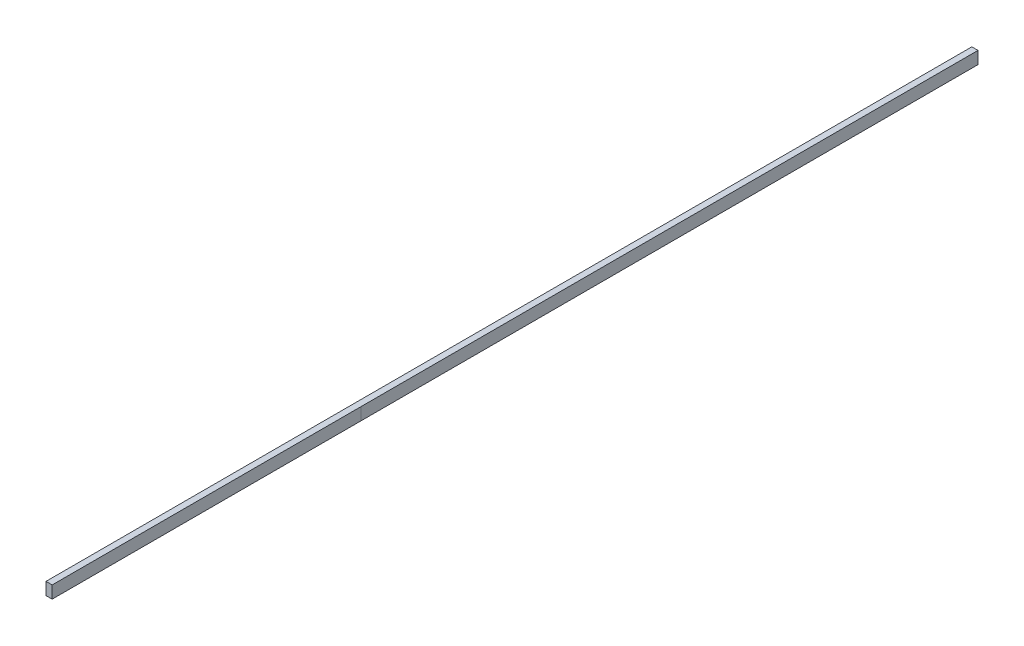
ISO-10303-21;
HEADER;
FILE_DESCRIPTION(('STEP AP214'),'2;1');
FILE_NAME('part.step','',(''),(''),'','','');
FILE_SCHEMA(('AUTOMOTIVE_DESIGN { 1 0 10303 214 1 1 1 1 }'));
ENDSEC;
DATA;
#1=APPLICATION_CONTEXT('core data for automotive mechanical design processes');
#2=APPLICATION_PROTOCOL_DEFINITION('international standard','automotive_design',2000,#1);
#3=PRODUCT_CONTEXT('',#1,'mechanical');
#4=PRODUCT('Part','Part','',(#3));
#5=PRODUCT_RELATED_PRODUCT_CATEGORY('part','',(#4));
#6=PRODUCT_DEFINITION_FORMATION('','',#4);
#7=PRODUCT_DEFINITION_CONTEXT('part definition',#1,'design');
#8=PRODUCT_DEFINITION('design','',#6,#7);
#9=PRODUCT_DEFINITION_SHAPE('','',#8);
#10=(LENGTH_UNIT() NAMED_UNIT(*) SI_UNIT(.MILLI.,.METRE.));
#11=(NAMED_UNIT(*) PLANE_ANGLE_UNIT() SI_UNIT($,.RADIAN.));
#12=(NAMED_UNIT(*) SI_UNIT($,.STERADIAN.) SOLID_ANGLE_UNIT());
#13=UNCERTAINTY_MEASURE_WITH_UNIT(LENGTH_MEASURE(1.E-05),#10,'distance_accuracy_value','');
#14=(GEOMETRIC_REPRESENTATION_CONTEXT(3) GLOBAL_UNCERTAINTY_ASSIGNED_CONTEXT((#13)) GLOBAL_UNIT_ASSIGNED_CONTEXT((#10,
#11,#12)) REPRESENTATION_CONTEXT('',''));
#15=CARTESIAN_POINT('',(0.,0.,0.));
#16=DIRECTION('',(0.,0.,1.));
#17=DIRECTION('',(1.,0.,0.));
#18=AXIS2_PLACEMENT_3D('',#15,#16,#17);
#19=CARTESIAN_POINT('',(10.,0.,1500.));
#20=DIRECTION('',(-1.,0.,0.));
#21=DIRECTION('',(0.,0.,1.));
#22=AXIS2_PLACEMENT_3D('',#19,#20,#21);
#23=PLANE('',#22);
#24=DIRECTION('',(0.,-1.,0.));
#25=VECTOR('',#24,1.);
#26=CARTESIAN_POINT('',(10.,0.,1000.));
#27=LINE('',#26,#25);
#28=CARTESIAN_POINT('',(10.,20.,1000.));
#29=VERTEX_POINT('',#28);
#30=CARTESIAN_POINT('',(10.,0.,1000.));
#31=VERTEX_POINT('',#30);
#32=EDGE_CURVE('E11',#29,#31,#27,.T.);
#33=ORIENTED_EDGE('',*,*,#32,.F.);
#34=DIRECTION('',(0.,0.,-1.));
#35=VECTOR('',#34,1.);
#36=CARTESIAN_POINT('',(10.,20.,1500.));
#37=LINE('',#36,#35);
#38=CARTESIAN_POINT('',(10.,20.,1500.));
#39=VERTEX_POINT('',#38);
#40=EDGE_CURVE('E134',#39,#29,#37,.T.);
#41=ORIENTED_EDGE('',*,*,#40,.F.);
#42=DIRECTION('',(0.,1.,0.));
#43=VECTOR('',#42,1.);
#44=CARTESIAN_POINT('',(10.,0.,1500.));
#45=LINE('',#44,#43);
#46=CARTESIAN_POINT('',(10.,0.,1500.));
#47=VERTEX_POINT('',#46);
#48=EDGE_CURVE('E109',#47,#39,#45,.T.);
#49=ORIENTED_EDGE('',*,*,#48,.F.);
#50=DIRECTION('',(0.,0.,-1.));
#51=VECTOR('',#50,1.);
#52=CARTESIAN_POINT('',(10.,0.,1500.));
#53=LINE('',#52,#51);
#54=EDGE_CURVE('E106',#47,#31,#53,.T.);
#55=ORIENTED_EDGE('',*,*,#54,.T.);
#56=EDGE_LOOP('',(#33,#41,#49,#55));
#57=FACE_BOUND('',#56,.T.);
#58=ADVANCED_FACE('F43',(#57),#23,.F.);
#59=CARTESIAN_POINT('',(0.,0.,1500.));
#60=DIRECTION('',(1.,0.,0.));
#61=DIRECTION('',(0.,0.,-1.));
#62=AXIS2_PLACEMENT_3D('',#59,#60,#61);
#63=PLANE('',#62);
#64=DIRECTION('',(0.,1.,0.));
#65=VECTOR('',#64,1.);
#66=CARTESIAN_POINT('',(0.,0.,1011.91903946928));
#67=LINE('',#66,#65);
#68=CARTESIAN_POINT('',(0.,0.,1011.91903946928));
#69=VERTEX_POINT('',#68);
#70=CARTESIAN_POINT('',(0.,20.,1011.91903946928));
#71=VERTEX_POINT('',#70);
#72=EDGE_CURVE('E52',#69,#71,#67,.T.);
#73=ORIENTED_EDGE('',*,*,#72,.F.);
#74=DIRECTION('',(0.,0.,-1.));
#75=VECTOR('',#74,1.);
#76=CARTESIAN_POINT('',(0.,0.,1500.));
#77=LINE('',#76,#75);
#78=CARTESIAN_POINT('',(0.,0.,1500.));
#79=VERTEX_POINT('',#78);
#80=EDGE_CURVE('E105',#79,#69,#77,.T.);
#81=ORIENTED_EDGE('',*,*,#80,.F.);
#82=DIRECTION('',(0.,-1.,0.));
#83=VECTOR('',#82,1.);
#84=CARTESIAN_POINT('',(0.,0.,1500.));
#85=LINE('',#84,#83);
#86=CARTESIAN_POINT('',(0.,20.,1500.));
#87=VERTEX_POINT('',#86);
#88=EDGE_CURVE('E110',#87,#79,#85,.T.);
#89=ORIENTED_EDGE('',*,*,#88,.F.);
#90=DIRECTION('',(0.,0.,-1.));
#91=VECTOR('',#90,1.);
#92=CARTESIAN_POINT('',(0.,20.,1500.));
#93=LINE('',#92,#91);
#94=EDGE_CURVE('E139',#87,#71,#93,.T.);
#95=ORIENTED_EDGE('',*,*,#94,.T.);
#96=EDGE_LOOP('',(#73,#81,#89,#95));
#97=FACE_BOUND('',#96,.T.);
#98=ADVANCED_FACE('F121',(#97),#63,.F.);
#99=DIRECTION('',(0.,-1.,0.));
#100=VECTOR('',#99,1.);
#101=CARTESIAN_POINT('',(0.,0.,1000.));
#102=LINE('',#101,#100);
#103=CARTESIAN_POINT('',(0.,20.,1000.));
#104=VERTEX_POINT('',#103);
#105=CARTESIAN_POINT('',(0.,0.,1000.));
#106=VERTEX_POINT('',#105);
#107=EDGE_CURVE('E123',#104,#106,#102,.T.);
#108=ORIENTED_EDGE('',*,*,#107,.F.);
#109=CARTESIAN_POINT('',(0.,20.,0.));
#110=VERTEX_POINT('',#109);
#111=EDGE_CURVE('E142',#104,#110,#93,.T.);
#112=ORIENTED_EDGE('',*,*,#111,.T.);
#113=DIRECTION('',(0.,-1.,0.));
#114=VECTOR('',#113,1.);
#115=CARTESIAN_POINT('',(0.,0.,0.));
#116=LINE('',#115,#114);
#117=CARTESIAN_POINT('',(0.,0.,0.));
#118=VERTEX_POINT('',#117);
#119=EDGE_CURVE('E150',#110,#118,#116,.T.);
#120=ORIENTED_EDGE('',*,*,#119,.T.);
#121=EDGE_CURVE('E126',#106,#118,#77,.T.);
#122=ORIENTED_EDGE('',*,*,#121,.F.);
#123=EDGE_LOOP('',(#108,#112,#120,#122));
#124=FACE_BOUND('',#123,.T.);
#125=ADVANCED_FACE('F161',(#124),#63,.F.);
#126=EDGE_CURVE('E124',#69,#106,#77,.T.);
#127=ORIENTED_EDGE('',*,*,#126,.F.);
#128=ORIENTED_EDGE('',*,*,#72,.T.);
#129=EDGE_CURVE('E141',#71,#104,#93,.T.);
#130=ORIENTED_EDGE('',*,*,#129,.T.);
#131=ORIENTED_EDGE('',*,*,#107,.T.);
#132=EDGE_LOOP('',(#127,#128,#130,#131));
#133=FACE_BOUND('',#132,.T.);
#134=ADVANCED_FACE('F45',(#133),#63,.F.);
#135=CARTESIAN_POINT('',(0.,0.,1500.));
#136=DIRECTION('',(0.,1.,0.));
#137=DIRECTION('',(0.,0.,1.));
#138=AXIS2_PLACEMENT_3D('',#135,#136,#137);
#139=PLANE('',#138);
#140=DIRECTION('',(1.,0.,0.));
#141=VECTOR('',#140,1.);
#142=CARTESIAN_POINT('',(0.,0.,0.));
#143=LINE('',#142,#141);
#144=CARTESIAN_POINT('',(10.,0.,0.));
#145=VERTEX_POINT('',#144);
#146=EDGE_CURVE('E148',#118,#145,#143,.T.);
#147=ORIENTED_EDGE('',*,*,#146,.T.);
#148=EDGE_CURVE('E133',#31,#145,#53,.T.);
#149=ORIENTED_EDGE('',*,*,#148,.F.);
#150=ORIENTED_EDGE('',*,*,#54,.F.);
#151=DIRECTION('',(1.,0.,0.));
#152=VECTOR('',#151,1.);
#153=CARTESIAN_POINT('',(0.,0.,1500.));
#154=LINE('',#153,#152);
#155=EDGE_CURVE('E100',#79,#47,#154,.T.);
#156=ORIENTED_EDGE('',*,*,#155,.F.);
#157=ORIENTED_EDGE('',*,*,#80,.T.);
#158=ORIENTED_EDGE('',*,*,#126,.T.);
#159=ORIENTED_EDGE('',*,*,#121,.T.);
#160=EDGE_LOOP('',(#147,#149,#150,#156,#157,#158,#159));
#161=FACE_BOUND('',#160,.T.);
#162=ADVANCED_FACE('F103',(#161),#139,.F.);
#163=CARTESIAN_POINT('',(10.,20.,0.));
#164=VERTEX_POINT('',#163);
#165=EDGE_CURVE('E138',#29,#164,#37,.T.);
#166=ORIENTED_EDGE('',*,*,#165,.F.);
#167=ORIENTED_EDGE('',*,*,#32,.T.);
#168=ORIENTED_EDGE('',*,*,#148,.T.);
#169=DIRECTION('',(0.,1.,0.));
#170=VECTOR('',#169,1.);
#171=CARTESIAN_POINT('',(10.,0.,0.));
#172=LINE('',#171,#170);
#173=EDGE_CURVE('E145',#145,#164,#172,.T.);
#174=ORIENTED_EDGE('',*,*,#173,.T.);
#175=EDGE_LOOP('',(#166,#167,#168,#174));
#176=FACE_BOUND('',#175,.T.);
#177=ADVANCED_FACE('F167',(#176),#23,.F.);
#178=CARTESIAN_POINT('',(0.,20.,1500.));
#179=DIRECTION('',(0.,-1.,0.));
#180=DIRECTION('',(0.,0.,-1.));
#181=AXIS2_PLACEMENT_3D('',#178,#179,#180);
#182=PLANE('',#181);
#183=DIRECTION('',(-1.,0.,0.));
#184=VECTOR('',#183,1.);
#185=CARTESIAN_POINT('',(0.,20.,0.));
#186=LINE('',#185,#184);
#187=EDGE_CURVE('E119',#164,#110,#186,.T.);
#188=ORIENTED_EDGE('',*,*,#187,.T.);
#189=ORIENTED_EDGE('',*,*,#111,.F.);
#190=ORIENTED_EDGE('',*,*,#129,.F.);
#191=ORIENTED_EDGE('',*,*,#94,.F.);
#192=DIRECTION('',(-1.,0.,0.));
#193=VECTOR('',#192,1.);
#194=CARTESIAN_POINT('',(0.,20.,1500.));
#195=LINE('',#194,#193);
#196=EDGE_CURVE('E115',#39,#87,#195,.T.);
#197=ORIENTED_EDGE('',*,*,#196,.F.);
#198=ORIENTED_EDGE('',*,*,#40,.T.);
#199=ORIENTED_EDGE('',*,*,#165,.T.);
#200=EDGE_LOOP('',(#188,#189,#190,#191,#197,#198,#199));
#201=FACE_BOUND('',#200,.T.);
#202=ADVANCED_FACE('F155',(#201),#182,.F.);
#203=CARTESIAN_POINT('',(0.,0.,1500.));
#204=DIRECTION('',(0.,0.,-1.));
#205=DIRECTION('',(-1.,0.,0.));
#206=AXIS2_PLACEMENT_3D('',#203,#204,#205);
#207=PLANE('',#206);
#208=ORIENTED_EDGE('',*,*,#88,.T.);
#209=ORIENTED_EDGE('',*,*,#155,.T.);
#210=ORIENTED_EDGE('',*,*,#48,.T.);
#211=ORIENTED_EDGE('',*,*,#196,.T.);
#212=EDGE_LOOP('',(#208,#209,#210,#211));
#213=FACE_BOUND('',#212,.T.);
#214=ADVANCED_FACE('F113',(#213),#207,.F.);
#215=CARTESIAN_POINT('',(0.,0.,0.));
#216=DIRECTION('',(0.,0.,-1.));
#217=DIRECTION('',(-1.,0.,0.));
#218=AXIS2_PLACEMENT_3D('',#215,#216,#217);
#219=PLANE('',#218);
#220=ORIENTED_EDGE('',*,*,#119,.F.);
#221=ORIENTED_EDGE('',*,*,#187,.F.);
#222=ORIENTED_EDGE('',*,*,#173,.F.);
#223=ORIENTED_EDGE('',*,*,#146,.F.);
#224=EDGE_LOOP('',(#220,#221,#222,#223));
#225=FACE_BOUND('',#224,.T.);
#226=ADVANCED_FACE('F166',(#225),#219,.T.);
#227=CLOSED_SHELL('',(#58,#98,#125,#134,#162,#177,#202,#214,#226));
#228=MANIFOLD_SOLID_BREP('B2',#227);
#229=ADVANCED_BREP_SHAPE_REPRESENTATION('',(#18,#228),#14);
#230=SHAPE_DEFINITION_REPRESENTATION(#9,#229);
ENDSEC;
END-ISO-10303-21;
